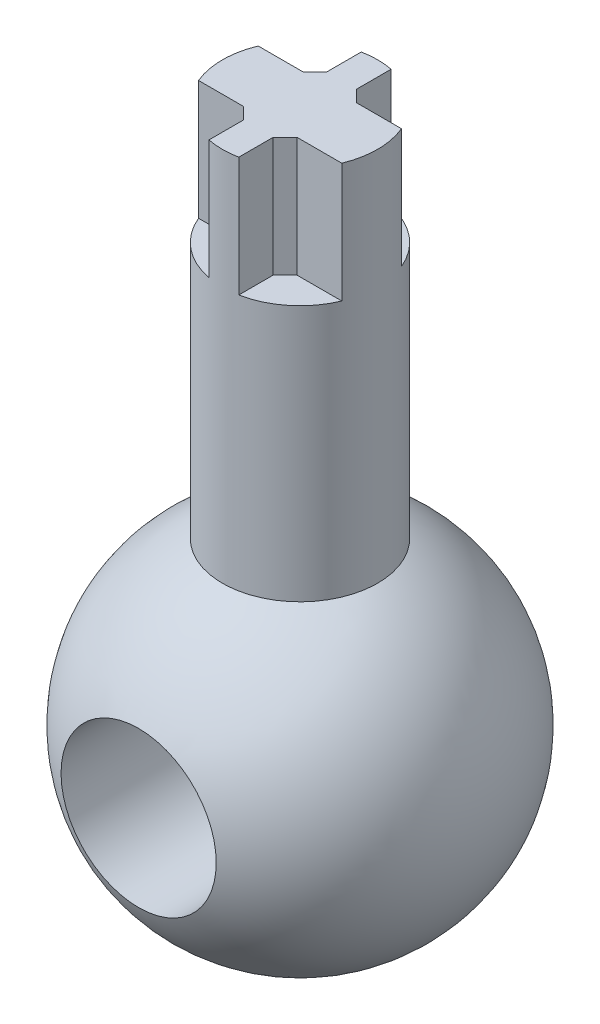
ISO-10303-21;
HEADER;
FILE_DESCRIPTION(('STEP AP214'),'2;1');
FILE_NAME('part.step','',(''),(''),'','','');
FILE_SCHEMA(('AUTOMOTIVE_DESIGN { 1 0 10303 214 1 1 1 1 }'));
ENDSEC;
DATA;
#1=APPLICATION_CONTEXT('core data for automotive mechanical design processes');
#2=APPLICATION_PROTOCOL_DEFINITION('international standard','automotive_design',2000,#1);
#3=PRODUCT_CONTEXT('',#1,'mechanical');
#4=PRODUCT('Part','Part','',(#3));
#5=PRODUCT_RELATED_PRODUCT_CATEGORY('part','',(#4));
#6=PRODUCT_DEFINITION_FORMATION('','',#4);
#7=PRODUCT_DEFINITION_CONTEXT('part definition',#1,'design');
#8=PRODUCT_DEFINITION('design','',#6,#7);
#9=PRODUCT_DEFINITION_SHAPE('','',#8);
#10=(LENGTH_UNIT() NAMED_UNIT(*) SI_UNIT(.MILLI.,.METRE.));
#11=(NAMED_UNIT(*) PLANE_ANGLE_UNIT() SI_UNIT($,.RADIAN.));
#12=(NAMED_UNIT(*) SI_UNIT($,.STERADIAN.) SOLID_ANGLE_UNIT());
#13=UNCERTAINTY_MEASURE_WITH_UNIT(LENGTH_MEASURE(1.E-05),#10,'distance_accuracy_value','');
#14=(GEOMETRIC_REPRESENTATION_CONTEXT(3) GLOBAL_UNCERTAINTY_ASSIGNED_CONTEXT((#13)) GLOBAL_UNIT_ASSIGNED_CONTEXT((#10,
#11,#12)) REPRESENTATION_CONTEXT('',''));
#15=CARTESIAN_POINT('',(0.,0.,0.));
#16=DIRECTION('',(0.,0.,1.));
#17=DIRECTION('',(1.,0.,0.));
#18=AXIS2_PLACEMENT_3D('',#15,#16,#17);
#19=CARTESIAN_POINT('',(0.,0.,0.));
#20=DIRECTION('',(-1.,0.,0.));
#21=DIRECTION('',(0.,1.,0.));
#22=AXIS2_PLACEMENT_3D('',#19,#20,#21);
#23=SPHERICAL_SURFACE('',#22,15.);
#24=CARTESIAN_POINT('',(0.,0.,13.5185058345958));
#25=DIRECTION('',(0.,0.,-1.));
#26=DIRECTION('',(-1.,0.,0.));
#27=AXIS2_PLACEMENT_3D('',#24,#25,#26);
#28=CIRCLE('',#27,6.5);
#29=CARTESIAN_POINT('',(-6.5,0.,13.5185058345958));
#30=VERTEX_POINT('',#29);
#31=EDGE_CURVE('E47',#30,#30,#28,.T.);
#32=ORIENTED_EDGE('',*,*,#31,.T.);
#33=EDGE_LOOP('',(#32));
#34=FACE_BOUND('',#33,.T.);
#35=CARTESIAN_POINT('',(0.,0.,-13.5185058345958));
#36=DIRECTION('',(0.,0.,1.));
#37=DIRECTION('',(1.,0.,0.));
#38=AXIS2_PLACEMENT_3D('',#35,#36,#37);
#39=CIRCLE('',#38,6.5);
#40=CARTESIAN_POINT('',(6.5,0.,-13.5185058345958));
#41=VERTEX_POINT('',#40);
#42=EDGE_CURVE('E280',#41,#41,#39,.T.);
#43=ORIENTED_EDGE('',*,*,#42,.T.);
#44=EDGE_LOOP('',(#43));
#45=FACE_BOUND('',#44,.T.);
#46=CARTESIAN_POINT('',(0.,13.5185058345958,0.));
#47=DIRECTION('',(0.,-1.,0.));
#48=DIRECTION('',(0.,0.,-1.));
#49=AXIS2_PLACEMENT_3D('',#46,#47,#48);
#50=CIRCLE('',#49,6.5);
#51=CARTESIAN_POINT('',(0.,13.5185058345958,-6.5));
#52=VERTEX_POINT('',#51);
#53=EDGE_CURVE('E246',#52,#52,#50,.F.);
#54=ORIENTED_EDGE('',*,*,#53,.F.);
#55=EDGE_LOOP('',(#54));
#56=FACE_BOUND('',#55,.T.);
#57=ADVANCED_FACE('F43',(#34,#45,#56),#23,.T.);
#58=CARTESIAN_POINT('',(0.,45.,0.));
#59=DIRECTION('',(0.,-1.,0.));
#60=DIRECTION('',(0.,0.,-1.));
#61=AXIS2_PLACEMENT_3D('',#58,#59,#60);
#62=CYLINDRICAL_SURFACE('',#61,6.5);
#63=CARTESIAN_POINT('',(0.,35.,0.));
#64=DIRECTION('',(0.,1.,0.));
#65=DIRECTION('',(0.,0.,1.));
#66=AXIS2_PLACEMENT_3D('',#63,#64,#65);
#67=CIRCLE('',#66,6.5);
#68=CARTESIAN_POINT('',(-6.,35.,2.5));
#69=VERTEX_POINT('',#68);
#70=CARTESIAN_POINT('',(-1.25,35.,6.37867541108654));
#71=VERTEX_POINT('',#70);
#72=EDGE_CURVE('E192',#69,#71,#67,.T.);
#73=ORIENTED_EDGE('',*,*,#72,.F.);
#74=DIRECTION('',(0.,1.,0.));
#75=VECTOR('',#74,1.);
#76=CARTESIAN_POINT('',(-6.,35.,2.5));
#77=LINE('',#76,#75);
#78=CARTESIAN_POINT('',(-6.,45.,2.5));
#79=VERTEX_POINT('',#78);
#80=EDGE_CURVE('E204',#69,#79,#77,.T.);
#81=ORIENTED_EDGE('',*,*,#80,.T.);
#82=CARTESIAN_POINT('',(0.,45.,0.));
#83=DIRECTION('',(0.,1.,0.));
#84=DIRECTION('',(0.,0.,1.));
#85=AXIS2_PLACEMENT_3D('',#82,#83,#84);
#86=CIRCLE('',#85,6.5);
#87=CARTESIAN_POINT('',(-6.,45.,-2.5));
#88=VERTEX_POINT('',#87);
#89=EDGE_CURVE('E243',#88,#79,#86,.T.);
#90=ORIENTED_EDGE('',*,*,#89,.F.);
#91=DIRECTION('',(0.,1.,0.));
#92=VECTOR('',#91,1.);
#93=CARTESIAN_POINT('',(-6.,35.,-2.5));
#94=LINE('',#93,#92);
#95=CARTESIAN_POINT('',(-6.,35.,-2.5));
#96=VERTEX_POINT('',#95);
#97=EDGE_CURVE('E236',#96,#88,#94,.T.);
#98=ORIENTED_EDGE('',*,*,#97,.F.);
#99=CARTESIAN_POINT('',(0.,35.,0.));
#100=DIRECTION('',(0.,1.,0.));
#101=DIRECTION('',(0.,0.,1.));
#102=AXIS2_PLACEMENT_3D('',#99,#100,#101);
#103=CIRCLE('',#102,6.5);
#104=CARTESIAN_POINT('',(-1.25,35.,-6.37867541108654));
#105=VERTEX_POINT('',#104);
#106=EDGE_CURVE('E227',#105,#96,#103,.T.);
#107=ORIENTED_EDGE('',*,*,#106,.F.);
#108=DIRECTION('',(0.,1.,0.));
#109=VECTOR('',#108,1.);
#110=CARTESIAN_POINT('',(-1.25,35.,-6.37867541108654));
#111=LINE('',#110,#109);
#112=CARTESIAN_POINT('',(-1.25,45.,-6.37867541108654));
#113=VERTEX_POINT('',#112);
#114=EDGE_CURVE('E240',#105,#113,#111,.T.);
#115=ORIENTED_EDGE('',*,*,#114,.T.);
#116=CARTESIAN_POINT('',(1.25,45.,-6.37867541108654));
#117=VERTEX_POINT('',#116);
#118=EDGE_CURVE('E184',#117,#113,#86,.T.);
#119=ORIENTED_EDGE('',*,*,#118,.F.);
#120=DIRECTION('',(0.,1.,0.));
#121=VECTOR('',#120,1.);
#122=CARTESIAN_POINT('',(1.25,35.,-6.37867541108654));
#123=LINE('',#122,#121);
#124=CARTESIAN_POINT('',(1.25,35.,-6.37867541108654));
#125=VERTEX_POINT('',#124);
#126=EDGE_CURVE('E161',#125,#117,#123,.T.);
#127=ORIENTED_EDGE('',*,*,#126,.F.);
#128=CARTESIAN_POINT('',(0.,35.,0.));
#129=DIRECTION('',(0.,1.,0.));
#130=DIRECTION('',(0.,0.,1.));
#131=AXIS2_PLACEMENT_3D('',#128,#129,#130);
#132=CIRCLE('',#131,6.5);
#133=CARTESIAN_POINT('',(6.,35.,-2.5));
#134=VERTEX_POINT('',#133);
#135=EDGE_CURVE('E168',#134,#125,#132,.T.);
#136=ORIENTED_EDGE('',*,*,#135,.F.);
#137=DIRECTION('',(0.,1.,0.));
#138=VECTOR('',#137,1.);
#139=CARTESIAN_POINT('',(6.,35.,-2.5));
#140=LINE('',#139,#138);
#141=CARTESIAN_POINT('',(6.,45.,-2.5));
#142=VERTEX_POINT('',#141);
#143=EDGE_CURVE('E185',#134,#142,#140,.T.);
#144=ORIENTED_EDGE('',*,*,#143,.T.);
#145=CARTESIAN_POINT('',(6.,45.,2.5));
#146=VERTEX_POINT('',#145);
#147=EDGE_CURVE('E335',#146,#142,#86,.T.);
#148=ORIENTED_EDGE('',*,*,#147,.F.);
#149=DIRECTION('',(0.,1.,0.));
#150=VECTOR('',#149,1.);
#151=CARTESIAN_POINT('',(6.,35.,2.5));
#152=LINE('',#151,#150);
#153=CARTESIAN_POINT('',(6.,35.,2.5));
#154=VERTEX_POINT('',#153);
#155=EDGE_CURVE('E218',#154,#146,#152,.T.);
#156=ORIENTED_EDGE('',*,*,#155,.F.);
#157=CARTESIAN_POINT('',(0.,35.,0.));
#158=DIRECTION('',(0.,1.,0.));
#159=DIRECTION('',(0.,0.,1.));
#160=AXIS2_PLACEMENT_3D('',#157,#158,#159);
#161=CIRCLE('',#160,6.5);
#162=CARTESIAN_POINT('',(1.25,35.,6.37867541108654));
#163=VERTEX_POINT('',#162);
#164=EDGE_CURVE('E209',#163,#154,#161,.T.);
#165=ORIENTED_EDGE('',*,*,#164,.F.);
#166=DIRECTION('',(0.,1.,0.));
#167=VECTOR('',#166,1.);
#168=CARTESIAN_POINT('',(1.25,35.,6.37867541108654));
#169=LINE('',#168,#167);
#170=CARTESIAN_POINT('',(1.25,45.,6.37867541108654));
#171=VERTEX_POINT('',#170);
#172=EDGE_CURVE('E222',#163,#171,#169,.T.);
#173=ORIENTED_EDGE('',*,*,#172,.T.);
#174=CARTESIAN_POINT('',(-1.25,45.,6.37867541108654));
#175=VERTEX_POINT('',#174);
#176=EDGE_CURVE('E247',#175,#171,#86,.T.);
#177=ORIENTED_EDGE('',*,*,#176,.F.);
#178=DIRECTION('',(0.,1.,0.));
#179=VECTOR('',#178,1.);
#180=CARTESIAN_POINT('',(-1.25,35.,6.37867541108654));
#181=LINE('',#180,#179);
#182=EDGE_CURVE('E200',#71,#175,#181,.T.);
#183=ORIENTED_EDGE('',*,*,#182,.F.);
#184=EDGE_LOOP('',(#73,#81,#90,#98,#107,#115,#119,#127,#136,#144,#148,#156,#165,#173,#177,#183));
#185=FACE_BOUND('',#184,.T.);
#186=ORIENTED_EDGE('',*,*,#53,.T.);
#187=EDGE_LOOP('',(#186));
#188=FACE_BOUND('',#187,.T.);
#189=ADVANCED_FACE('F180',(#185,#188),#62,.T.);
#190=CARTESIAN_POINT('',(0.,45.,0.));
#191=DIRECTION('',(0.,1.,0.));
#192=DIRECTION('',(0.,0.,1.));
#193=AXIS2_PLACEMENT_3D('',#190,#191,#192);
#194=PLANE('',#193);
#195=DIRECTION('',(-1.,0.,0.));
#196=VECTOR('',#195,1.);
#197=CARTESIAN_POINT('',(-1.25,45.,2.5));
#198=LINE('',#197,#196);
#199=CARTESIAN_POINT('',(-2.25000000000002,45.,2.5));
#200=VERTEX_POINT('',#199);
#201=EDGE_CURVE('E196',#200,#79,#198,.T.);
#202=ORIENTED_EDGE('',*,*,#201,.F.);
#203=DIRECTION('',(-0.707106781186551,0.,-0.707106781186544));
#204=VECTOR('',#203,1.);
#205=CARTESIAN_POINT('',(-2.25000000000002,45.,2.5));
#206=LINE('',#205,#204);
#207=CARTESIAN_POINT('',(-1.25,45.,3.50000000000001));
#208=VERTEX_POINT('',#207);
#209=EDGE_CURVE('E11',#200,#208,#206,.F.);
#210=ORIENTED_EDGE('',*,*,#209,.T.);
#211=DIRECTION('',(0.,0.,-1.));
#212=VECTOR('',#211,1.);
#213=CARTESIAN_POINT('',(-1.25,45.,2.5));
#214=LINE('',#213,#212);
#215=EDGE_CURVE('E201',#175,#208,#214,.T.);
#216=ORIENTED_EDGE('',*,*,#215,.F.);
#217=ORIENTED_EDGE('',*,*,#176,.T.);
#218=DIRECTION('',(0.,0.,1.));
#219=VECTOR('',#218,1.);
#220=CARTESIAN_POINT('',(1.25,45.,2.5));
#221=LINE('',#220,#219);
#222=CARTESIAN_POINT('',(1.25,45.,3.50000000000002));
#223=VERTEX_POINT('',#222);
#224=EDGE_CURVE('E213',#223,#171,#221,.T.);
#225=ORIENTED_EDGE('',*,*,#224,.F.);
#226=DIRECTION('',(-0.707106781186544,0.,0.707106781186551));
#227=VECTOR('',#226,1.);
#228=CARTESIAN_POINT('',(1.25,45.,3.50000000000002));
#229=LINE('',#228,#227);
#230=CARTESIAN_POINT('',(2.25000000000001,45.,2.5));
#231=VERTEX_POINT('',#230);
#232=EDGE_CURVE('E52',#223,#231,#229,.F.);
#233=ORIENTED_EDGE('',*,*,#232,.T.);
#234=DIRECTION('',(-1.,0.,0.));
#235=VECTOR('',#234,1.);
#236=CARTESIAN_POINT('',(6.,45.,2.5));
#237=LINE('',#236,#235);
#238=EDGE_CURVE('E187',#146,#231,#237,.T.);
#239=ORIENTED_EDGE('',*,*,#238,.F.);
#240=ORIENTED_EDGE('',*,*,#147,.T.);
#241=DIRECTION('',(1.,0.,0.));
#242=VECTOR('',#241,1.);
#243=CARTESIAN_POINT('',(6.,45.,-2.5));
#244=LINE('',#243,#242);
#245=CARTESIAN_POINT('',(2.25000000000002,45.,-2.5));
#246=VERTEX_POINT('',#245);
#247=EDGE_CURVE('E176',#246,#142,#244,.T.);
#248=ORIENTED_EDGE('',*,*,#247,.F.);
#249=DIRECTION('',(0.707106781186551,0.,0.707106781186544));
#250=VECTOR('',#249,1.);
#251=CARTESIAN_POINT('',(2.25000000000002,45.,-2.5));
#252=LINE('',#251,#250);
#253=CARTESIAN_POINT('',(1.25,45.,-3.50000000000001));
#254=VERTEX_POINT('',#253);
#255=EDGE_CURVE('E278',#246,#254,#252,.F.);
#256=ORIENTED_EDGE('',*,*,#255,.T.);
#257=DIRECTION('',(0.,0.,1.));
#258=VECTOR('',#257,1.);
#259=CARTESIAN_POINT('',(1.25,45.,-6.37867541108654));
#260=LINE('',#259,#258);
#261=EDGE_CURVE('E207',#117,#254,#260,.T.);
#262=ORIENTED_EDGE('',*,*,#261,.F.);
#263=ORIENTED_EDGE('',*,*,#118,.T.);
#264=DIRECTION('',(0.,0.,-1.));
#265=VECTOR('',#264,1.);
#266=CARTESIAN_POINT('',(-1.25,45.,-6.37867541108654));
#267=LINE('',#266,#265);
#268=CARTESIAN_POINT('',(-1.25,45.,-3.50000000000002));
#269=VERTEX_POINT('',#268);
#270=EDGE_CURVE('E231',#269,#113,#267,.T.);
#271=ORIENTED_EDGE('',*,*,#270,.F.);
#272=DIRECTION('',(0.707106781186544,0.,-0.707106781186551));
#273=VECTOR('',#272,1.);
#274=CARTESIAN_POINT('',(-1.25,45.,-3.50000000000002));
#275=LINE('',#274,#273);
#276=CARTESIAN_POINT('',(-2.25000000000001,45.,-2.5));
#277=VERTEX_POINT('',#276);
#278=EDGE_CURVE('E276',#269,#277,#275,.F.);
#279=ORIENTED_EDGE('',*,*,#278,.T.);
#280=DIRECTION('',(1.,0.,0.));
#281=VECTOR('',#280,1.);
#282=CARTESIAN_POINT('',(-1.25,45.,-2.5));
#283=LINE('',#282,#281);
#284=EDGE_CURVE('E225',#88,#277,#283,.T.);
#285=ORIENTED_EDGE('',*,*,#284,.F.);
#286=ORIENTED_EDGE('',*,*,#89,.T.);
#287=EDGE_LOOP('',(#202,#210,#216,#217,#225,#233,#239,#240,#248,#256,#262,#263,#271,#279,#285,#286));
#288=FACE_BOUND('',#287,.T.);
#289=ADVANCED_FACE('F303',(#288),#194,.T.);
#290=CARTESIAN_POINT('',(-1.25,35.,-6.37867541108654));
#291=DIRECTION('',(1.,0.,0.));
#292=DIRECTION('',(0.,0.,-1.));
#293=AXIS2_PLACEMENT_3D('',#290,#291,#292);
#294=PLANE('',#293);
#295=DIRECTION('',(0.,0.,-1.));
#296=VECTOR('',#295,1.);
#297=CARTESIAN_POINT('',(-1.25,35.,-6.37867541108654));
#298=LINE('',#297,#296);
#299=CARTESIAN_POINT('',(-1.25,35.,-3.50000000000002));
#300=VERTEX_POINT('',#299);
#301=EDGE_CURVE('E234',#300,#105,#298,.T.);
#302=ORIENTED_EDGE('',*,*,#301,.F.);
#303=DIRECTION('',(0.,1.,0.));
#304=VECTOR('',#303,1.);
#305=CARTESIAN_POINT('',(-1.25,45.,-3.50000000000002));
#306=LINE('',#305,#304);
#307=EDGE_CURVE('E250',#300,#269,#306,.T.);
#308=ORIENTED_EDGE('',*,*,#307,.T.);
#309=ORIENTED_EDGE('',*,*,#270,.T.);
#310=ORIENTED_EDGE('',*,*,#114,.F.);
#311=EDGE_LOOP('',(#302,#308,#309,#310));
#312=FACE_BOUND('',#311,.T.);
#313=ADVANCED_FACE('F347',(#312),#294,.F.);
#314=CARTESIAN_POINT('',(-1.25,35.,-2.5));
#315=DIRECTION('',(0.,0.,1.));
#316=DIRECTION('',(1.,0.,0.));
#317=AXIS2_PLACEMENT_3D('',#314,#315,#316);
#318=PLANE('',#317);
#319=ORIENTED_EDGE('',*,*,#284,.T.);
#320=DIRECTION('',(0.,-1.,0.));
#321=VECTOR('',#320,1.);
#322=CARTESIAN_POINT('',(-2.25000000000001,35.,-2.5));
#323=LINE('',#322,#321);
#324=CARTESIAN_POINT('',(-2.25000000000001,35.,-2.5));
#325=VERTEX_POINT('',#324);
#326=EDGE_CURVE('E253',#277,#325,#323,.T.);
#327=ORIENTED_EDGE('',*,*,#326,.T.);
#328=DIRECTION('',(1.,0.,0.));
#329=VECTOR('',#328,1.);
#330=CARTESIAN_POINT('',(-1.25,35.,-2.5));
#331=LINE('',#330,#329);
#332=EDGE_CURVE('E230',#96,#325,#331,.T.);
#333=ORIENTED_EDGE('',*,*,#332,.F.);
#334=ORIENTED_EDGE('',*,*,#97,.T.);
#335=EDGE_LOOP('',(#319,#327,#333,#334));
#336=FACE_BOUND('',#335,.T.);
#337=ADVANCED_FACE('F354',(#336),#318,.F.);
#338=CARTESIAN_POINT('',(0.,35.,0.));
#339=DIRECTION('',(0.,1.,0.));
#340=DIRECTION('',(0.,0.,1.));
#341=AXIS2_PLACEMENT_3D('',#338,#339,#340);
#342=PLANE('',#341);
#343=ORIENTED_EDGE('',*,*,#332,.T.);
#344=DIRECTION('',(-0.707106781186544,0.,0.707106781186551));
#345=VECTOR('',#344,1.);
#346=CARTESIAN_POINT('',(-2.37500000000002,35.,-2.37499999999999));
#347=LINE('',#346,#345);
#348=EDGE_CURVE('E255',#325,#300,#347,.F.);
#349=ORIENTED_EDGE('',*,*,#348,.T.);
#350=ORIENTED_EDGE('',*,*,#301,.T.);
#351=ORIENTED_EDGE('',*,*,#106,.T.);
#352=EDGE_LOOP('',(#343,#349,#350,#351));
#353=FACE_BOUND('',#352,.T.);
#354=ADVANCED_FACE('F377',(#353),#342,.T.);
#355=CARTESIAN_POINT('',(1.25,35.,2.5));
#356=DIRECTION('',(-1.,0.,0.));
#357=DIRECTION('',(0.,0.,1.));
#358=AXIS2_PLACEMENT_3D('',#355,#356,#357);
#359=PLANE('',#358);
#360=DIRECTION('',(0.,0.,1.));
#361=VECTOR('',#360,1.);
#362=CARTESIAN_POINT('',(1.25,35.,2.5));
#363=LINE('',#362,#361);
#364=CARTESIAN_POINT('',(1.25,35.,3.50000000000002));
#365=VERTEX_POINT('',#364);
#366=EDGE_CURVE('E216',#365,#163,#363,.T.);
#367=ORIENTED_EDGE('',*,*,#366,.F.);
#368=DIRECTION('',(0.,1.,0.));
#369=VECTOR('',#368,1.);
#370=CARTESIAN_POINT('',(1.25,45.,3.50000000000002));
#371=LINE('',#370,#369);
#372=EDGE_CURVE('E263',#365,#223,#371,.T.);
#373=ORIENTED_EDGE('',*,*,#372,.T.);
#374=ORIENTED_EDGE('',*,*,#224,.T.);
#375=ORIENTED_EDGE('',*,*,#172,.F.);
#376=EDGE_LOOP('',(#367,#373,#374,#375));
#377=FACE_BOUND('',#376,.T.);
#378=ADVANCED_FACE('F327',(#377),#359,.F.);
#379=CARTESIAN_POINT('',(6.,35.,2.5));
#380=DIRECTION('',(0.,0.,-1.));
#381=DIRECTION('',(-1.,0.,0.));
#382=AXIS2_PLACEMENT_3D('',#379,#380,#381);
#383=PLANE('',#382);
#384=ORIENTED_EDGE('',*,*,#238,.T.);
#385=DIRECTION('',(0.,-1.,0.));
#386=VECTOR('',#385,1.);
#387=CARTESIAN_POINT('',(2.25000000000001,35.,2.5));
#388=LINE('',#387,#386);
#389=CARTESIAN_POINT('',(2.25000000000001,35.,2.5));
#390=VERTEX_POINT('',#389);
#391=EDGE_CURVE('E266',#231,#390,#388,.T.);
#392=ORIENTED_EDGE('',*,*,#391,.T.);
#393=DIRECTION('',(-1.,0.,0.));
#394=VECTOR('',#393,1.);
#395=CARTESIAN_POINT('',(6.,35.,2.5));
#396=LINE('',#395,#394);
#397=EDGE_CURVE('E212',#154,#390,#396,.T.);
#398=ORIENTED_EDGE('',*,*,#397,.F.);
#399=ORIENTED_EDGE('',*,*,#155,.T.);
#400=EDGE_LOOP('',(#384,#392,#398,#399));
#401=FACE_BOUND('',#400,.T.);
#402=ADVANCED_FACE('F338',(#401),#383,.F.);
#403=CARTESIAN_POINT('',(0.,35.,0.));
#404=DIRECTION('',(0.,1.,0.));
#405=DIRECTION('',(0.,0.,1.));
#406=AXIS2_PLACEMENT_3D('',#403,#404,#405);
#407=PLANE('',#406);
#408=ORIENTED_EDGE('',*,*,#397,.T.);
#409=DIRECTION('',(0.707106781186544,0.,-0.707106781186551));
#410=VECTOR('',#409,1.);
#411=CARTESIAN_POINT('',(2.37500000000002,35.,2.37499999999999));
#412=LINE('',#411,#410);
#413=EDGE_CURVE('E268',#390,#365,#412,.F.);
#414=ORIENTED_EDGE('',*,*,#413,.T.);
#415=ORIENTED_EDGE('',*,*,#366,.T.);
#416=ORIENTED_EDGE('',*,*,#164,.T.);
#417=EDGE_LOOP('',(#408,#414,#415,#416));
#418=FACE_BOUND('',#417,.T.);
#419=ADVANCED_FACE('F324',(#418),#407,.T.);
#420=CARTESIAN_POINT('',(6.,35.,-2.5));
#421=DIRECTION('',(0.,0.,1.));
#422=DIRECTION('',(1.,0.,0.));
#423=AXIS2_PLACEMENT_3D('',#420,#421,#422);
#424=PLANE('',#423);
#425=DIRECTION('',(1.,0.,0.));
#426=VECTOR('',#425,1.);
#427=CARTESIAN_POINT('',(6.,35.,-2.5));
#428=LINE('',#427,#426);
#429=CARTESIAN_POINT('',(2.25000000000002,35.,-2.5));
#430=VERTEX_POINT('',#429);
#431=EDGE_CURVE('E167',#430,#134,#428,.T.);
#432=ORIENTED_EDGE('',*,*,#431,.F.);
#433=DIRECTION('',(0.,1.,0.));
#434=VECTOR('',#433,1.);
#435=CARTESIAN_POINT('',(2.25000000000002,45.,-2.5));
#436=LINE('',#435,#434);
#437=EDGE_CURVE('E257',#430,#246,#436,.T.);
#438=ORIENTED_EDGE('',*,*,#437,.T.);
#439=ORIENTED_EDGE('',*,*,#247,.T.);
#440=ORIENTED_EDGE('',*,*,#143,.F.);
#441=EDGE_LOOP('',(#432,#438,#439,#440));
#442=FACE_BOUND('',#441,.T.);
#443=ADVANCED_FACE('F374',(#442),#424,.F.);
#444=CARTESIAN_POINT('',(1.25,35.,-6.37867541108654));
#445=DIRECTION('',(-1.,0.,0.));
#446=DIRECTION('',(0.,0.,1.));
#447=AXIS2_PLACEMENT_3D('',#444,#445,#446);
#448=PLANE('',#447);
#449=ORIENTED_EDGE('',*,*,#261,.T.);
#450=DIRECTION('',(0.,-1.,0.));
#451=VECTOR('',#450,1.);
#452=CARTESIAN_POINT('',(1.25,35.,-3.50000000000001));
#453=LINE('',#452,#451);
#454=CARTESIAN_POINT('',(1.25,35.,-3.50000000000001));
#455=VERTEX_POINT('',#454);
#456=EDGE_CURVE('E164',#254,#455,#453,.T.);
#457=ORIENTED_EDGE('',*,*,#456,.T.);
#458=DIRECTION('',(0.,0.,1.));
#459=VECTOR('',#458,1.);
#460=CARTESIAN_POINT('',(1.25,35.,-6.37867541108654));
#461=LINE('',#460,#459);
#462=EDGE_CURVE('E156',#125,#455,#461,.T.);
#463=ORIENTED_EDGE('',*,*,#462,.F.);
#464=ORIENTED_EDGE('',*,*,#126,.T.);
#465=EDGE_LOOP('',(#449,#457,#463,#464));
#466=FACE_BOUND('',#465,.T.);
#467=ADVANCED_FACE('F159',(#466),#448,.F.);
#468=CARTESIAN_POINT('',(0.,35.,0.));
#469=DIRECTION('',(0.,1.,0.));
#470=DIRECTION('',(0.,0.,1.));
#471=AXIS2_PLACEMENT_3D('',#468,#469,#470);
#472=PLANE('',#471);
#473=ORIENTED_EDGE('',*,*,#462,.T.);
#474=DIRECTION('',(-0.707106781186551,0.,-0.707106781186544));
#475=VECTOR('',#474,1.);
#476=CARTESIAN_POINT('',(2.375,35.,-2.37500000000002));
#477=LINE('',#476,#475);
#478=EDGE_CURVE('E261',#455,#430,#477,.F.);
#479=ORIENTED_EDGE('',*,*,#478,.T.);
#480=ORIENTED_EDGE('',*,*,#431,.T.);
#481=ORIENTED_EDGE('',*,*,#135,.T.);
#482=EDGE_LOOP('',(#473,#479,#480,#481));
#483=FACE_BOUND('',#482,.T.);
#484=ADVANCED_FACE('F171',(#483),#472,.T.);
#485=CARTESIAN_POINT('',(-1.25,35.,2.5));
#486=DIRECTION('',(0.,0.,-1.));
#487=DIRECTION('',(-1.,0.,0.));
#488=AXIS2_PLACEMENT_3D('',#485,#486,#487);
#489=PLANE('',#488);
#490=DIRECTION('',(-1.,0.,0.));
#491=VECTOR('',#490,1.);
#492=CARTESIAN_POINT('',(-1.25,35.,2.5));
#493=LINE('',#492,#491);
#494=CARTESIAN_POINT('',(-2.25000000000002,35.,2.5));
#495=VERTEX_POINT('',#494);
#496=EDGE_CURVE('E198',#495,#69,#493,.T.);
#497=ORIENTED_EDGE('',*,*,#496,.F.);
#498=DIRECTION('',(0.,1.,0.));
#499=VECTOR('',#498,1.);
#500=CARTESIAN_POINT('',(-2.25000000000002,45.,2.5));
#501=LINE('',#500,#499);
#502=EDGE_CURVE('E270',#495,#200,#501,.T.);
#503=ORIENTED_EDGE('',*,*,#502,.T.);
#504=ORIENTED_EDGE('',*,*,#201,.T.);
#505=ORIENTED_EDGE('',*,*,#80,.F.);
#506=EDGE_LOOP('',(#497,#503,#504,#505));
#507=FACE_BOUND('',#506,.T.);
#508=ADVANCED_FACE('F358',(#507),#489,.F.);
#509=CARTESIAN_POINT('',(-1.25,35.,2.5));
#510=DIRECTION('',(1.,0.,0.));
#511=DIRECTION('',(0.,0.,-1.));
#512=AXIS2_PLACEMENT_3D('',#509,#510,#511);
#513=PLANE('',#512);
#514=ORIENTED_EDGE('',*,*,#215,.T.);
#515=DIRECTION('',(0.,-1.,0.));
#516=VECTOR('',#515,1.);
#517=CARTESIAN_POINT('',(-1.25,35.,3.50000000000001));
#518=LINE('',#517,#516);
#519=CARTESIAN_POINT('',(-1.25,35.,3.50000000000001));
#520=VERTEX_POINT('',#519);
#521=EDGE_CURVE('E60',#208,#520,#518,.T.);
#522=ORIENTED_EDGE('',*,*,#521,.T.);
#523=DIRECTION('',(0.,0.,-1.));
#524=VECTOR('',#523,1.);
#525=CARTESIAN_POINT('',(-1.25,35.,2.5));
#526=LINE('',#525,#524);
#527=EDGE_CURVE('E195',#71,#520,#526,.T.);
#528=ORIENTED_EDGE('',*,*,#527,.F.);
#529=ORIENTED_EDGE('',*,*,#182,.T.);
#530=EDGE_LOOP('',(#514,#522,#528,#529));
#531=FACE_BOUND('',#530,.T.);
#532=ADVANCED_FACE('F362',(#531),#513,.F.);
#533=CARTESIAN_POINT('',(0.,35.,0.));
#534=DIRECTION('',(0.,1.,0.));
#535=DIRECTION('',(0.,0.,1.));
#536=AXIS2_PLACEMENT_3D('',#533,#534,#535);
#537=PLANE('',#536);
#538=ORIENTED_EDGE('',*,*,#527,.T.);
#539=DIRECTION('',(0.707106781186551,0.,0.707106781186544));
#540=VECTOR('',#539,1.);
#541=CARTESIAN_POINT('',(-2.375,35.,2.37500000000002));
#542=LINE('',#541,#540);
#543=EDGE_CURVE('E274',#520,#495,#542,.F.);
#544=ORIENTED_EDGE('',*,*,#543,.T.);
#545=ORIENTED_EDGE('',*,*,#496,.T.);
#546=ORIENTED_EDGE('',*,*,#72,.T.);
#547=EDGE_LOOP('',(#538,#544,#545,#546));
#548=FACE_BOUND('',#547,.T.);
#549=ADVANCED_FACE('F311',(#548),#537,.T.);
#550=CARTESIAN_POINT('',(-1.25,35.,-3.50000000000002));
#551=DIRECTION('',(-0.707106781186551,0.,-0.707106781186544));
#552=DIRECTION('',(-0.707106781186544,0.,0.707106781186551));
#553=AXIS2_PLACEMENT_3D('',#550,#551,#552);
#554=PLANE('',#553);
#555=ORIENTED_EDGE('',*,*,#348,.F.);
#556=ORIENTED_EDGE('',*,*,#326,.F.);
#557=ORIENTED_EDGE('',*,*,#278,.F.);
#558=ORIENTED_EDGE('',*,*,#307,.F.);
#559=EDGE_LOOP('',(#555,#556,#557,#558));
#560=FACE_BOUND('',#559,.T.);
#561=ADVANCED_FACE('F307',(#560),#554,.T.);
#562=CARTESIAN_POINT('',(2.25000000000002,35.,-2.5));
#563=DIRECTION('',(0.707106781186544,0.,-0.707106781186551));
#564=DIRECTION('',(-0.707106781186551,0.,-0.707106781186544));
#565=AXIS2_PLACEMENT_3D('',#562,#563,#564);
#566=PLANE('',#565);
#567=ORIENTED_EDGE('',*,*,#478,.F.);
#568=ORIENTED_EDGE('',*,*,#456,.F.);
#569=ORIENTED_EDGE('',*,*,#255,.F.);
#570=ORIENTED_EDGE('',*,*,#437,.F.);
#571=EDGE_LOOP('',(#567,#568,#569,#570));
#572=FACE_BOUND('',#571,.T.);
#573=ADVANCED_FACE('F310',(#572),#566,.T.);
#574=CARTESIAN_POINT('',(1.25,35.,3.50000000000002));
#575=DIRECTION('',(0.707106781186551,0.,0.707106781186544));
#576=DIRECTION('',(0.707106781186544,0.,-0.707106781186551));
#577=AXIS2_PLACEMENT_3D('',#574,#575,#576);
#578=PLANE('',#577);
#579=ORIENTED_EDGE('',*,*,#413,.F.);
#580=ORIENTED_EDGE('',*,*,#391,.F.);
#581=ORIENTED_EDGE('',*,*,#232,.F.);
#582=ORIENTED_EDGE('',*,*,#372,.F.);
#583=EDGE_LOOP('',(#579,#580,#581,#582));
#584=FACE_BOUND('',#583,.T.);
#585=ADVANCED_FACE('F295',(#584),#578,.T.);
#586=CARTESIAN_POINT('',(-2.25000000000002,35.,2.5));
#587=DIRECTION('',(-0.707106781186544,0.,0.707106781186551));
#588=DIRECTION('',(0.707106781186551,0.,0.707106781186544));
#589=AXIS2_PLACEMENT_3D('',#586,#587,#588);
#590=PLANE('',#589);
#591=ORIENTED_EDGE('',*,*,#543,.F.);
#592=ORIENTED_EDGE('',*,*,#521,.F.);
#593=ORIENTED_EDGE('',*,*,#209,.F.);
#594=ORIENTED_EDGE('',*,*,#502,.F.);
#595=EDGE_LOOP('',(#591,#592,#593,#594));
#596=FACE_BOUND('',#595,.T.);
#597=ADVANCED_FACE('F45',(#596),#590,.T.);
#598=CARTESIAN_POINT('',(0.,0.,-15.));
#599=DIRECTION('',(0.,0.,1.));
#600=DIRECTION('',(1.,0.,0.));
#601=AXIS2_PLACEMENT_3D('',#598,#599,#600);
#602=CYLINDRICAL_SURFACE('',#601,6.5);
#603=ORIENTED_EDGE('',*,*,#42,.F.);
#604=EDGE_LOOP('',(#603));
#605=FACE_BOUND('',#604,.T.);
#606=ORIENTED_EDGE('',*,*,#31,.F.);
#607=EDGE_LOOP('',(#606));
#608=FACE_BOUND('',#607,.T.);
#609=ADVANCED_FACE('F288',(#605,#608),#602,.F.);
#610=CLOSED_SHELL('',(#57,#189,#289,#313,#337,#354,#378,#402,#419,#443,#467,#484,#508,#532,#549,
#561,#573,#585,#597,#609));
#611=MANIFOLD_SOLID_BREP('B2',#610);
#612=ADVANCED_BREP_SHAPE_REPRESENTATION('',(#18,#611),#14);
#613=SHAPE_DEFINITION_REPRESENTATION(#9,#612);
ENDSEC;
END-ISO-10303-21;
